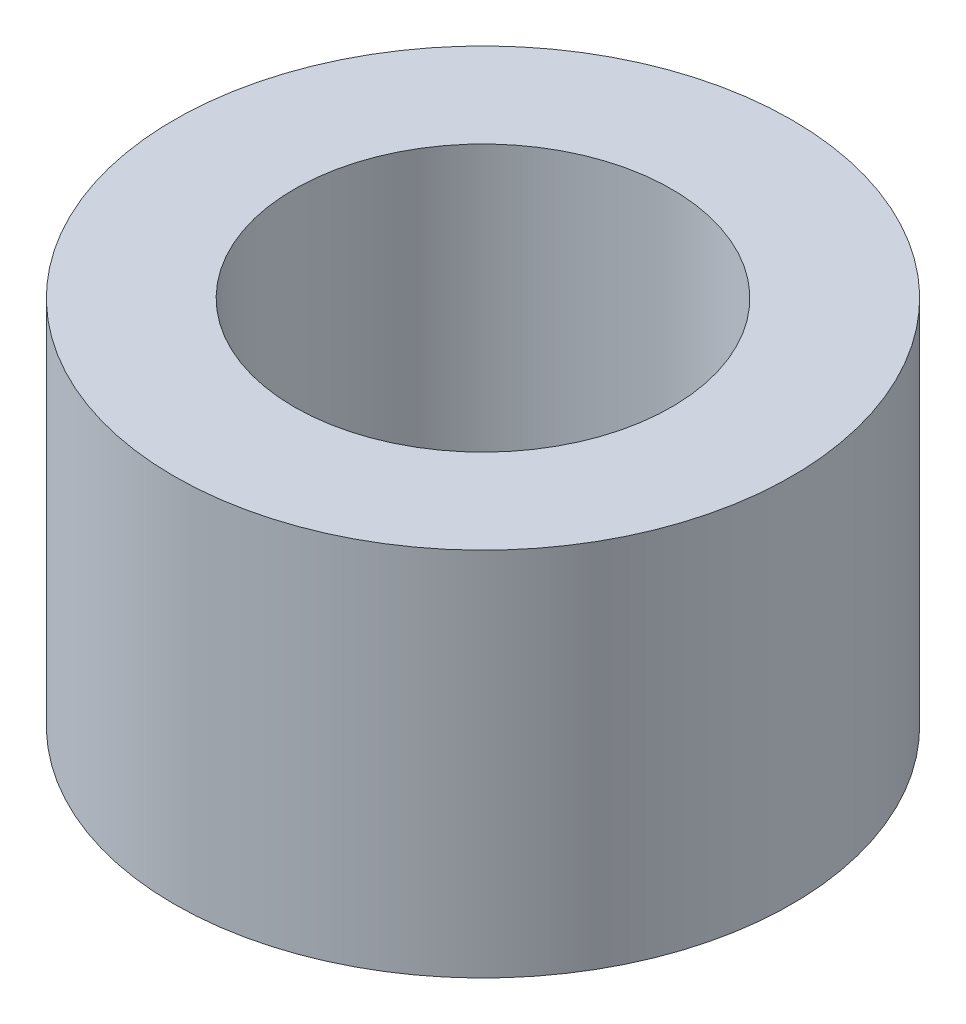
ISO-10303-21;
HEADER;
FILE_DESCRIPTION(('STEP AP214'),'2;1');
FILE_NAME('part.step','',(''),(''),'','','');
FILE_SCHEMA(('AUTOMOTIVE_DESIGN { 1 0 10303 214 1 1 1 1 }'));
ENDSEC;
DATA;
#1=APPLICATION_CONTEXT('core data for automotive mechanical design processes');
#2=APPLICATION_PROTOCOL_DEFINITION('international standard','automotive_design',2000,#1);
#3=PRODUCT_CONTEXT('',#1,'mechanical');
#4=PRODUCT('Part','Part','',(#3));
#5=PRODUCT_RELATED_PRODUCT_CATEGORY('part','',(#4));
#6=PRODUCT_DEFINITION_FORMATION('','',#4);
#7=PRODUCT_DEFINITION_CONTEXT('part definition',#1,'design');
#8=PRODUCT_DEFINITION('design','',#6,#7);
#9=PRODUCT_DEFINITION_SHAPE('','',#8);
#10=(LENGTH_UNIT() NAMED_UNIT(*) SI_UNIT(.MILLI.,.METRE.));
#11=(NAMED_UNIT(*) PLANE_ANGLE_UNIT() SI_UNIT($,.RADIAN.));
#12=(NAMED_UNIT(*) SI_UNIT($,.STERADIAN.) SOLID_ANGLE_UNIT());
#13=UNCERTAINTY_MEASURE_WITH_UNIT(LENGTH_MEASURE(1.E-05),#10,'distance_accuracy_value','');
#14=(GEOMETRIC_REPRESENTATION_CONTEXT(3) GLOBAL_UNCERTAINTY_ASSIGNED_CONTEXT((#13)) GLOBAL_UNIT_ASSIGNED_CONTEXT((#10,
#11,#12)) REPRESENTATION_CONTEXT('',''));
#15=CARTESIAN_POINT('',(0.,0.,0.));
#16=DIRECTION('',(0.,0.,1.));
#17=DIRECTION('',(1.,0.,0.));
#18=AXIS2_PLACEMENT_3D('',#15,#16,#17);
#19=CARTESIAN_POINT('',(0.,9.525,0.));
#20=DIRECTION('',(0.,1.,0.));
#21=DIRECTION('',(0.,0.,1.));
#22=AXIS2_PLACEMENT_3D('',#19,#20,#21);
#23=PLANE('',#22);
#24=CARTESIAN_POINT('',(0.,9.525,0.));
#25=DIRECTION('',(0.,1.,0.));
#26=DIRECTION('',(0.,0.,1.));
#27=AXIS2_PLACEMENT_3D('',#24,#25,#26);
#28=CIRCLE('',#27,7.9375);
#29=CARTESIAN_POINT('',(0.,9.525,7.9375));
#30=VERTEX_POINT('',#29);
#31=EDGE_CURVE('E10',#30,#30,#28,.T.);
#32=ORIENTED_EDGE('',*,*,#31,.T.);
#33=EDGE_LOOP('',(#32));
#34=FACE_BOUND('',#33,.T.);
#35=CARTESIAN_POINT('',(0.,9.525,0.));
#36=DIRECTION('',(0.,1.,0.));
#37=DIRECTION('',(0.,0.,1.));
#38=AXIS2_PLACEMENT_3D('',#35,#36,#37);
#39=CIRCLE('',#38,4.8514);
#40=CARTESIAN_POINT('',(0.,9.525,4.8514));
#41=VERTEX_POINT('',#40);
#42=EDGE_CURVE('E42',#41,#41,#39,.T.);
#43=ORIENTED_EDGE('',*,*,#42,.F.);
#44=EDGE_LOOP('',(#43));
#45=FACE_BOUND('',#44,.T.);
#46=ADVANCED_FACE('F31',(#34,#45),#23,.T.);
#47=CARTESIAN_POINT('',(0.,0.,0.));
#48=DIRECTION('',(0.,1.,0.));
#49=DIRECTION('',(0.,0.,1.));
#50=AXIS2_PLACEMENT_3D('',#47,#48,#49);
#51=PLANE('',#50);
#52=CARTESIAN_POINT('',(0.,0.,0.));
#53=DIRECTION('',(0.,1.,0.));
#54=DIRECTION('',(0.,0.,1.));
#55=AXIS2_PLACEMENT_3D('',#52,#53,#54);
#56=CIRCLE('',#55,7.9375);
#57=CARTESIAN_POINT('',(0.,0.,7.9375));
#58=VERTEX_POINT('',#57);
#59=EDGE_CURVE('E35',#58,#58,#56,.T.);
#60=ORIENTED_EDGE('',*,*,#59,.F.);
#61=EDGE_LOOP('',(#60));
#62=FACE_BOUND('',#61,.T.);
#63=CARTESIAN_POINT('',(0.,0.,0.));
#64=DIRECTION('',(0.,1.,0.));
#65=DIRECTION('',(0.,0.,1.));
#66=AXIS2_PLACEMENT_3D('',#63,#64,#65);
#67=CIRCLE('',#66,4.8514);
#68=CARTESIAN_POINT('',(0.,0.,4.8514));
#69=VERTEX_POINT('',#68);
#70=EDGE_CURVE('E44',#69,#69,#67,.T.);
#71=ORIENTED_EDGE('',*,*,#70,.T.);
#72=EDGE_LOOP('',(#71));
#73=FACE_BOUND('',#72,.T.);
#74=ADVANCED_FACE('F54',(#62,#73),#51,.F.);
#75=CARTESIAN_POINT('',(0.,9.525,0.));
#76=DIRECTION('',(0.,-1.,0.));
#77=DIRECTION('',(0.,0.,-1.));
#78=AXIS2_PLACEMENT_3D('',#75,#76,#77);
#79=CYLINDRICAL_SURFACE('',#78,7.9375);
#80=ORIENTED_EDGE('',*,*,#31,.F.);
#81=EDGE_LOOP('',(#80));
#82=FACE_BOUND('',#81,.T.);
#83=ORIENTED_EDGE('',*,*,#59,.T.);
#84=EDGE_LOOP('',(#83));
#85=FACE_BOUND('',#84,.T.);
#86=ADVANCED_FACE('F33',(#82,#85),#79,.T.);
#87=CARTESIAN_POINT('',(0.,9.525,0.));
#88=DIRECTION('',(0.,-1.,0.));
#89=DIRECTION('',(0.,0.,-1.));
#90=AXIS2_PLACEMENT_3D('',#87,#88,#89);
#91=CYLINDRICAL_SURFACE('',#90,4.8514);
#92=ORIENTED_EDGE('',*,*,#42,.T.);
#93=EDGE_LOOP('',(#92));
#94=FACE_BOUND('',#93,.T.);
#95=ORIENTED_EDGE('',*,*,#70,.F.);
#96=EDGE_LOOP('',(#95));
#97=FACE_BOUND('',#96,.T.);
#98=ADVANCED_FACE('F50',(#94,#97),#91,.F.);
#99=CLOSED_SHELL('',(#46,#74,#86,#98));
#100=MANIFOLD_SOLID_BREP('B2',#99);
#101=ADVANCED_BREP_SHAPE_REPRESENTATION('',(#18,#100),#14);
#102=SHAPE_DEFINITION_REPRESENTATION(#9,#101);
ENDSEC;
END-ISO-10303-21;
